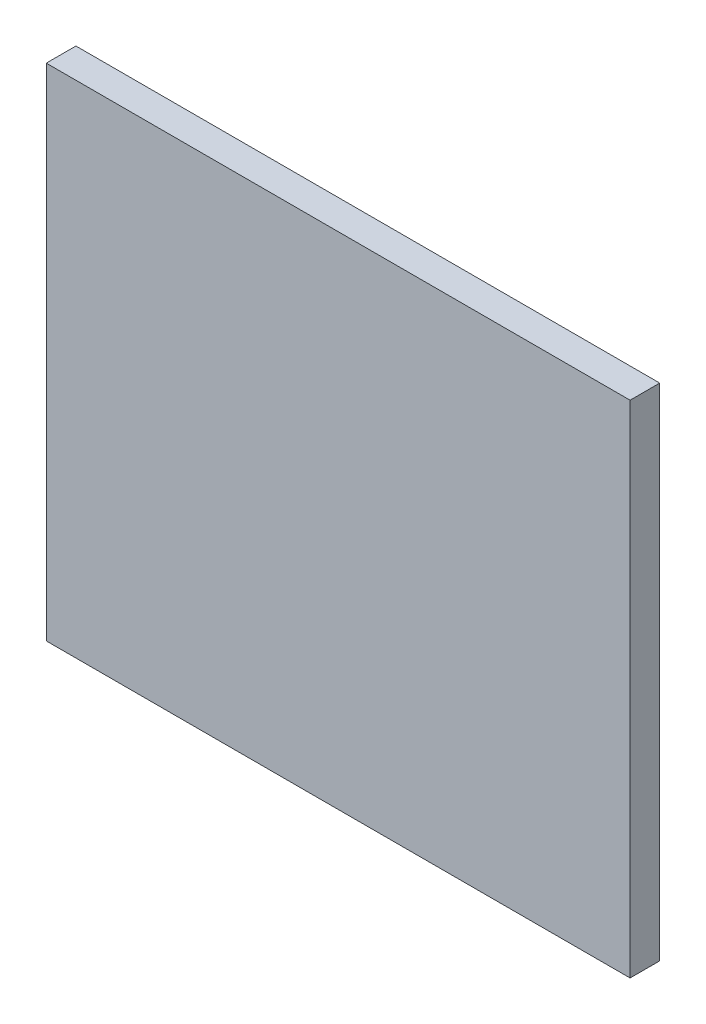
ISO-10303-21;
HEADER;
FILE_DESCRIPTION(('STEP AP214'),'2;1');
FILE_NAME('part.step','',(''),(''),'','','');
FILE_SCHEMA(('AUTOMOTIVE_DESIGN { 1 0 10303 214 1 1 1 1 }'));
ENDSEC;
DATA;
#1=APPLICATION_CONTEXT('core data for automotive mechanical design processes');
#2=APPLICATION_PROTOCOL_DEFINITION('international standard','automotive_design',2000,#1);
#3=PRODUCT_CONTEXT('',#1,'mechanical');
#4=PRODUCT('Part','Part','',(#3));
#5=PRODUCT_RELATED_PRODUCT_CATEGORY('part','',(#4));
#6=PRODUCT_DEFINITION_FORMATION('','',#4);
#7=PRODUCT_DEFINITION_CONTEXT('part definition',#1,'design');
#8=PRODUCT_DEFINITION('design','',#6,#7);
#9=PRODUCT_DEFINITION_SHAPE('','',#8);
#10=(LENGTH_UNIT() NAMED_UNIT(*) SI_UNIT(.MILLI.,.METRE.));
#11=(NAMED_UNIT(*) PLANE_ANGLE_UNIT() SI_UNIT($,.RADIAN.));
#12=(NAMED_UNIT(*) SI_UNIT($,.STERADIAN.) SOLID_ANGLE_UNIT());
#13=UNCERTAINTY_MEASURE_WITH_UNIT(LENGTH_MEASURE(1.E-05),#10,'distance_accuracy_value','');
#14=(GEOMETRIC_REPRESENTATION_CONTEXT(3) GLOBAL_UNCERTAINTY_ASSIGNED_CONTEXT((#13)) GLOBAL_UNIT_ASSIGNED_CONTEXT((#10,
#11,#12)) REPRESENTATION_CONTEXT('',''));
#15=CARTESIAN_POINT('',(0.,0.,0.));
#16=DIRECTION('',(0.,0.,1.));
#17=DIRECTION('',(1.,0.,0.));
#18=AXIS2_PLACEMENT_3D('',#15,#16,#17);
#19=CARTESIAN_POINT('',(96.0169982910156,83.8870010375977,0.));
#20=DIRECTION('',(0.,1.,0.));
#21=DIRECTION('',(1.,0.,0.));
#22=AXIS2_PLACEMENT_3D('',#19,#20,#21);
#23=PLANE('',#22);
#24=DIRECTION('',(1.,0.,0.));
#25=VECTOR('',#24,1.);
#26=CARTESIAN_POINT('',(96.0169982910156,83.8870010375977,0.03556));
#27=LINE('',#26,#25);
#28=CARTESIAN_POINT('',(96.0169982910156,83.8870010375977,0.03556));
#29=VERTEX_POINT('',#28);
#30=CARTESIAN_POINT('',(96.7170028686523,83.8870010375977,0.03556));
#31=VERTEX_POINT('',#30);
#32=EDGE_CURVE('E11',#29,#31,#27,.T.);
#33=ORIENTED_EDGE('',*,*,#32,.F.);
#34=DIRECTION('',(0.,0.,1.));
#35=VECTOR('',#34,1.);
#36=CARTESIAN_POINT('',(96.0169982910156,83.8870010375977,0.));
#37=LINE('',#36,#35);
#38=CARTESIAN_POINT('',(96.0169982910156,83.8870010375977,0.));
#39=VERTEX_POINT('',#38);
#40=EDGE_CURVE('E24',#39,#29,#37,.T.);
#41=ORIENTED_EDGE('',*,*,#40,.F.);
#42=DIRECTION('',(1.,0.,0.));
#43=VECTOR('',#42,1.);
#44=CARTESIAN_POINT('',(96.0169982910156,83.8870010375977,0.));
#45=LINE('',#44,#43);
#46=CARTESIAN_POINT('',(96.7170028686523,83.8870010375977,0.));
#47=VERTEX_POINT('',#46);
#48=EDGE_CURVE('E75',#39,#47,#45,.T.);
#49=ORIENTED_EDGE('',*,*,#48,.T.);
#50=DIRECTION('',(0.,0.,1.));
#51=VECTOR('',#50,1.);
#52=CARTESIAN_POINT('',(96.7170028686523,83.8870010375977,0.));
#53=LINE('',#52,#51);
#54=EDGE_CURVE('E37',#47,#31,#53,.T.);
#55=ORIENTED_EDGE('',*,*,#54,.T.);
#56=EDGE_LOOP('',(#33,#41,#49,#55));
#57=FACE_BOUND('',#56,.T.);
#58=ADVANCED_FACE('F17',(#57),#23,.F.);
#59=CARTESIAN_POINT('',(96.7170028686523,83.8870010375977,0.));
#60=DIRECTION('',(-1.,0.,0.));
#61=DIRECTION('',(0.,1.,0.));
#62=AXIS2_PLACEMENT_3D('',#59,#60,#61);
#63=PLANE('',#62);
#64=DIRECTION('',(0.,1.,0.));
#65=VECTOR('',#64,1.);
#66=CARTESIAN_POINT('',(96.7170028686523,83.8870010375977,0.03556));
#67=LINE('',#66,#65);
#68=CARTESIAN_POINT('',(96.7170028686523,84.4869995117188,0.03556));
#69=VERTEX_POINT('',#68);
#70=EDGE_CURVE('E83',#31,#69,#67,.T.);
#71=ORIENTED_EDGE('',*,*,#70,.F.);
#72=ORIENTED_EDGE('',*,*,#54,.F.);
#73=DIRECTION('',(0.,1.,0.));
#74=VECTOR('',#73,1.);
#75=CARTESIAN_POINT('',(96.7170028686523,83.8870010375977,0.));
#76=LINE('',#75,#74);
#77=CARTESIAN_POINT('',(96.7170028686523,84.4869995117188,0.));
#78=VERTEX_POINT('',#77);
#79=EDGE_CURVE('E81',#47,#78,#76,.T.);
#80=ORIENTED_EDGE('',*,*,#79,.T.);
#81=DIRECTION('',(0.,0.,1.));
#82=VECTOR('',#81,1.);
#83=CARTESIAN_POINT('',(96.7170028686523,84.4869995117188,0.));
#84=LINE('',#83,#82);
#85=EDGE_CURVE('E67',#78,#69,#84,.T.);
#86=ORIENTED_EDGE('',*,*,#85,.T.);
#87=EDGE_LOOP('',(#71,#72,#80,#86));
#88=FACE_BOUND('',#87,.T.);
#89=ADVANCED_FACE('F89',(#88),#63,.F.);
#90=CARTESIAN_POINT('',(96.7170028686523,84.4869995117188,0.));
#91=DIRECTION('',(0.,-1.,0.));
#92=DIRECTION('',(-1.,0.,0.));
#93=AXIS2_PLACEMENT_3D('',#90,#91,#92);
#94=PLANE('',#93);
#95=DIRECTION('',(-1.,0.,0.));
#96=VECTOR('',#95,1.);
#97=CARTESIAN_POINT('',(96.7170028686523,84.4869995117188,0.03556));
#98=LINE('',#97,#96);
#99=CARTESIAN_POINT('',(96.0169982910156,84.4869995117188,0.03556));
#100=VERTEX_POINT('',#99);
#101=EDGE_CURVE('E71',#69,#100,#98,.T.);
#102=ORIENTED_EDGE('',*,*,#101,.F.);
#103=ORIENTED_EDGE('',*,*,#85,.F.);
#104=DIRECTION('',(-1.,0.,0.));
#105=VECTOR('',#104,1.);
#106=CARTESIAN_POINT('',(96.7170028686523,84.4869995117188,0.));
#107=LINE('',#106,#105);
#108=CARTESIAN_POINT('',(96.0169982910156,84.4869995117188,0.));
#109=VERTEX_POINT('',#108);
#110=EDGE_CURVE('E63',#78,#109,#107,.T.);
#111=ORIENTED_EDGE('',*,*,#110,.T.);
#112=DIRECTION('',(0.,0.,1.));
#113=VECTOR('',#112,1.);
#114=CARTESIAN_POINT('',(96.0169982910156,84.4869995117188,0.));
#115=LINE('',#114,#113);
#116=EDGE_CURVE('E53',#109,#100,#115,.T.);
#117=ORIENTED_EDGE('',*,*,#116,.T.);
#118=EDGE_LOOP('',(#102,#103,#111,#117));
#119=FACE_BOUND('',#118,.T.);
#120=ADVANCED_FACE('F66',(#119),#94,.F.);
#121=CARTESIAN_POINT('',(96.0169982910156,84.4869995117188,0.));
#122=DIRECTION('',(1.,0.,0.));
#123=DIRECTION('',(0.,-1.,0.));
#124=AXIS2_PLACEMENT_3D('',#121,#122,#123);
#125=PLANE('',#124);
#126=DIRECTION('',(0.,-1.,0.));
#127=VECTOR('',#126,1.);
#128=CARTESIAN_POINT('',(96.0169982910156,84.4869995117188,0.03556));
#129=LINE('',#128,#127);
#130=EDGE_CURVE('E59',#100,#29,#129,.T.);
#131=ORIENTED_EDGE('',*,*,#130,.F.);
#132=ORIENTED_EDGE('',*,*,#116,.F.);
#133=DIRECTION('',(0.,-1.,0.));
#134=VECTOR('',#133,1.);
#135=CARTESIAN_POINT('',(96.0169982910156,84.4869995117188,0.));
#136=LINE('',#135,#134);
#137=EDGE_CURVE('E57',#109,#39,#136,.T.);
#138=ORIENTED_EDGE('',*,*,#137,.T.);
#139=ORIENTED_EDGE('',*,*,#40,.T.);
#140=EDGE_LOOP('',(#131,#132,#138,#139));
#141=FACE_BOUND('',#140,.T.);
#142=ADVANCED_FACE('F55',(#141),#125,.F.);
#143=CARTESIAN_POINT('',(96.0169982910156,83.8870010375977,0.));
#144=DIRECTION('',(0.,0.,-1.));
#145=DIRECTION('',(-1.,0.,0.));
#146=AXIS2_PLACEMENT_3D('',#143,#144,#145);
#147=PLANE('',#146);
#148=ORIENTED_EDGE('',*,*,#137,.F.);
#149=ORIENTED_EDGE('',*,*,#110,.F.);
#150=ORIENTED_EDGE('',*,*,#79,.F.);
#151=ORIENTED_EDGE('',*,*,#48,.F.);
#152=EDGE_LOOP('',(#148,#149,#150,#151));
#153=FACE_BOUND('',#152,.T.);
#154=ADVANCED_FACE('F74',(#153),#147,.T.);
#155=CARTESIAN_POINT('',(96.0169982910156,83.8870010375977,0.03556));
#156=DIRECTION('',(0.,0.,-1.));
#157=DIRECTION('',(-1.,0.,0.));
#158=AXIS2_PLACEMENT_3D('',#155,#156,#157);
#159=PLANE('',#158);
#160=ORIENTED_EDGE('',*,*,#32,.T.);
#161=ORIENTED_EDGE('',*,*,#70,.T.);
#162=ORIENTED_EDGE('',*,*,#101,.T.);
#163=ORIENTED_EDGE('',*,*,#130,.T.);
#164=EDGE_LOOP('',(#160,#161,#162,#163));
#165=FACE_BOUND('',#164,.T.);
#166=ADVANCED_FACE('F91',(#165),#159,.F.);
#167=CLOSED_SHELL('',(#58,#89,#120,#142,#154,#166));
#168=MANIFOLD_SOLID_BREP('B1',#167);
#169=ADVANCED_BREP_SHAPE_REPRESENTATION('',(#18,#168),#14);
#170=SHAPE_DEFINITION_REPRESENTATION(#9,#169);
ENDSEC;
END-ISO-10303-21;
